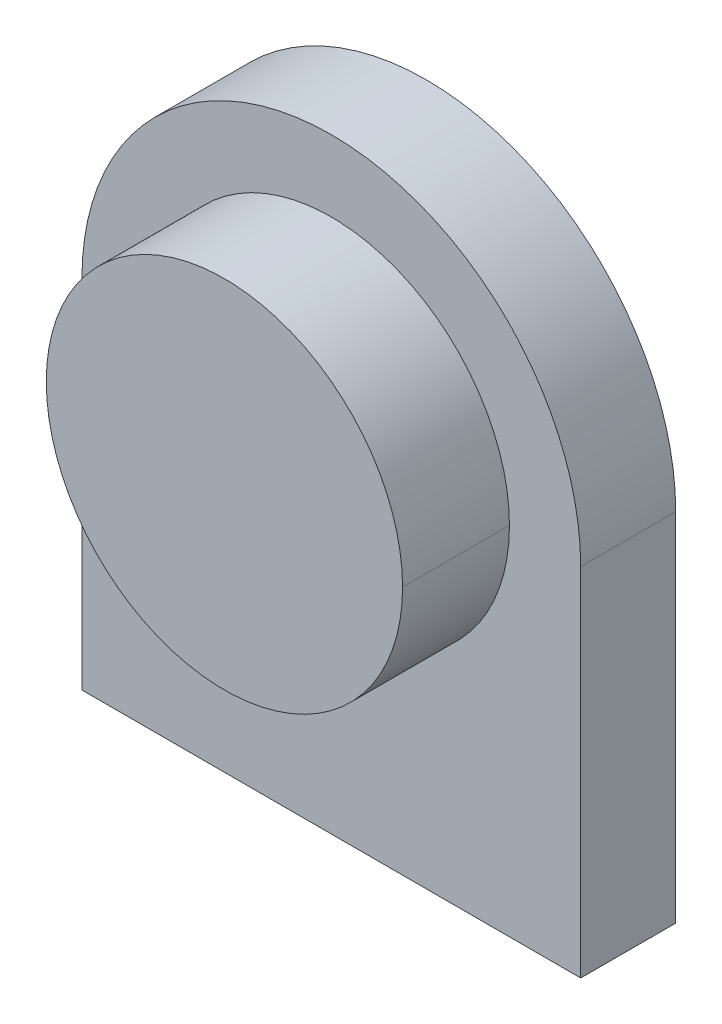
ISO-10303-21;
HEADER;
FILE_DESCRIPTION(('STEP AP214'),'2;1');
FILE_NAME('part.step','',(''),(''),'','','');
FILE_SCHEMA(('AUTOMOTIVE_DESIGN { 1 0 10303 214 1 1 1 1 }'));
ENDSEC;
DATA;
#1=APPLICATION_CONTEXT('core data for automotive mechanical design processes');
#2=APPLICATION_PROTOCOL_DEFINITION('international standard','automotive_design',2000,#1);
#3=PRODUCT_CONTEXT('',#1,'mechanical');
#4=PRODUCT('Part','Part','',(#3));
#5=PRODUCT_RELATED_PRODUCT_CATEGORY('part','',(#4));
#6=PRODUCT_DEFINITION_FORMATION('','',#4);
#7=PRODUCT_DEFINITION_CONTEXT('part definition',#1,'design');
#8=PRODUCT_DEFINITION('design','',#6,#7);
#9=PRODUCT_DEFINITION_SHAPE('','',#8);
#10=(LENGTH_UNIT() NAMED_UNIT(*) SI_UNIT(.MILLI.,.METRE.));
#11=(NAMED_UNIT(*) PLANE_ANGLE_UNIT() SI_UNIT($,.RADIAN.));
#12=(NAMED_UNIT(*) SI_UNIT($,.STERADIAN.) SOLID_ANGLE_UNIT());
#13=UNCERTAINTY_MEASURE_WITH_UNIT(LENGTH_MEASURE(1.E-05),#10,'distance_accuracy_value','');
#14=(GEOMETRIC_REPRESENTATION_CONTEXT(3) GLOBAL_UNCERTAINTY_ASSIGNED_CONTEXT((#13)) GLOBAL_UNIT_ASSIGNED_CONTEXT((#10,
#11,#12)) REPRESENTATION_CONTEXT('',''));
#15=CARTESIAN_POINT('',(0.,0.,0.));
#16=DIRECTION('',(0.,0.,1.));
#17=DIRECTION('',(1.,0.,0.));
#18=AXIS2_PLACEMENT_3D('',#15,#16,#17);
#19=CARTESIAN_POINT('',(0.,0.,5.));
#20=DIRECTION('',(0.,0.,-1.));
#21=DIRECTION('',(-1.,0.,0.));
#22=AXIS2_PLACEMENT_3D('',#19,#20,#21);
#23=CYLINDRICAL_SURFACE('',#22,7.5);
#24=DIRECTION('',(0.,0.,-1.));
#25=VECTOR('',#24,1.);
#26=CARTESIAN_POINT('',(-7.5,0.,5.));
#27=LINE('',#26,#25);
#28=CARTESIAN_POINT('',(-7.5,0.,4.5));
#29=VERTEX_POINT('',#28);
#30=CARTESIAN_POINT('',(-7.5,0.,0.));
#31=VERTEX_POINT('',#30);
#32=EDGE_CURVE('E167',#29,#31,#27,.T.);
#33=ORIENTED_EDGE('',*,*,#32,.F.);
#34=CARTESIAN_POINT('',(0.,0.,4.5));
#35=DIRECTION('',(0.,0.,1.));
#36=DIRECTION('',(1.,0.,0.));
#37=AXIS2_PLACEMENT_3D('',#34,#35,#36);
#38=CIRCLE('',#37,7.5);
#39=CARTESIAN_POINT('',(7.5,0.,4.5));
#40=VERTEX_POINT('',#39);
#41=EDGE_CURVE('E68',#40,#29,#38,.T.);
#42=ORIENTED_EDGE('',*,*,#41,.F.);
#43=DIRECTION('',(0.,0.,-1.));
#44=VECTOR('',#43,1.);
#45=CARTESIAN_POINT('',(7.5,0.,5.));
#46=LINE('',#45,#44);
#47=CARTESIAN_POINT('',(7.5,0.,0.));
#48=VERTEX_POINT('',#47);
#49=EDGE_CURVE('E101',#40,#48,#46,.T.);
#50=ORIENTED_EDGE('',*,*,#49,.T.);
#51=CARTESIAN_POINT('',(0.,0.,0.));
#52=DIRECTION('',(0.,0.,1.));
#53=DIRECTION('',(1.,0.,0.));
#54=AXIS2_PLACEMENT_3D('',#51,#52,#53);
#55=CIRCLE('',#54,7.5);
#56=EDGE_CURVE('E170',#48,#31,#55,.T.);
#57=ORIENTED_EDGE('',*,*,#56,.T.);
#58=EDGE_LOOP('',(#33,#42,#50,#57));
#59=FACE_BOUND('',#58,.T.);
#60=ADVANCED_FACE('F51',(#59),#23,.T.);
#61=CARTESIAN_POINT('',(0.,0.,5.));
#62=DIRECTION('',(0.,0.,-1.));
#63=DIRECTION('',(-1.,0.,0.));
#64=AXIS2_PLACEMENT_3D('',#61,#62,#63);
#65=CYLINDRICAL_SURFACE('',#64,7.5);
#66=ORIENTED_EDGE('',*,*,#49,.F.);
#67=EDGE_CURVE('E366',#29,#40,#38,.T.);
#68=ORIENTED_EDGE('',*,*,#67,.F.);
#69=ORIENTED_EDGE('',*,*,#32,.T.);
#70=CARTESIAN_POINT('',(0.,0.,0.));
#71=DIRECTION('',(0.,0.,1.));
#72=DIRECTION('',(1.,0.,0.));
#73=AXIS2_PLACEMENT_3D('',#70,#71,#72);
#74=CIRCLE('',#73,7.5);
#75=EDGE_CURVE('E125',#31,#48,#74,.T.);
#76=ORIENTED_EDGE('',*,*,#75,.T.);
#77=EDGE_LOOP('',(#66,#68,#69,#76));
#78=FACE_BOUND('',#77,.T.);
#79=ADVANCED_FACE('F269',(#78),#65,.T.);
#80=CARTESIAN_POINT('',(0.,0.,-4.));
#81=DIRECTION('',(0.,0.,1.));
#82=DIRECTION('',(1.,0.,0.));
#83=AXIS2_PLACEMENT_3D('',#80,#81,#82);
#84=CYLINDRICAL_SURFACE('',#83,10.5);
#85=CARTESIAN_POINT('',(0.,0.,-4.));
#86=DIRECTION('',(0.,0.,-1.));
#87=DIRECTION('',(-1.,0.,0.));
#88=AXIS2_PLACEMENT_3D('',#85,#86,#87);
#89=CIRCLE('',#88,10.5);
#90=CARTESIAN_POINT('',(-10.5,0.,-4.));
#91=VERTEX_POINT('',#90);
#92=CARTESIAN_POINT('',(10.5,0.,-4.));
#93=VERTEX_POINT('',#92);
#94=EDGE_CURVE('E55',#91,#93,#89,.T.);
#95=ORIENTED_EDGE('',*,*,#94,.F.);
#96=DIRECTION('',(0.,0.,1.));
#97=VECTOR('',#96,1.);
#98=CARTESIAN_POINT('',(-10.5,0.,-4.));
#99=LINE('',#98,#97);
#100=CARTESIAN_POINT('',(-10.5,0.,0.));
#101=VERTEX_POINT('',#100);
#102=EDGE_CURVE('E12',#91,#101,#99,.T.);
#103=ORIENTED_EDGE('',*,*,#102,.T.);
#104=CARTESIAN_POINT('',(0.,0.,0.));
#105=DIRECTION('',(0.,0.,-1.));
#106=DIRECTION('',(-1.,0.,0.));
#107=AXIS2_PLACEMENT_3D('',#104,#105,#106);
#108=CIRCLE('',#107,10.5);
#109=CARTESIAN_POINT('',(10.5,0.,0.));
#110=VERTEX_POINT('',#109);
#111=EDGE_CURVE('E61',#101,#110,#108,.T.);
#112=ORIENTED_EDGE('',*,*,#111,.T.);
#113=DIRECTION('',(0.,0.,1.));
#114=VECTOR('',#113,1.);
#115=CARTESIAN_POINT('',(10.5,0.,-4.));
#116=LINE('',#115,#114);
#117=EDGE_CURVE('E116',#93,#110,#116,.T.);
#118=ORIENTED_EDGE('',*,*,#117,.F.);
#119=EDGE_LOOP('',(#95,#103,#112,#118));
#120=FACE_BOUND('',#119,.T.);
#121=ADVANCED_FACE('F119',(#120),#84,.T.);
#122=CARTESIAN_POINT('',(0.,0.,-4.));
#123=DIRECTION('',(0.,0.,-1.));
#124=DIRECTION('',(0.,-1.,0.));
#125=AXIS2_PLACEMENT_3D('',#122,#123,#124);
#126=PLANE('',#125);
#127=CARTESIAN_POINT('',(0.,0.,-4.));
#128=DIRECTION('',(0.,0.,-1.));
#129=DIRECTION('',(0.,1.,0.));
#130=AXIS2_PLACEMENT_3D('',#127,#128,#129);
#131=CIRCLE('',#130,9.25);
#132=CARTESIAN_POINT('',(0.,9.25,-4.));
#133=VERTEX_POINT('',#132);
#134=EDGE_CURVE('E155',#133,#133,#131,.T.);
#135=ORIENTED_EDGE('',*,*,#134,.F.);
#136=EDGE_LOOP('',(#135));
#137=FACE_BOUND('',#136,.T.);
#138=ORIENTED_EDGE('',*,*,#94,.T.);
#139=DIRECTION('',(0.,1.,0.));
#140=VECTOR('',#139,1.);
#141=CARTESIAN_POINT('',(10.5,0.,-4.));
#142=LINE('',#141,#140);
#143=CARTESIAN_POINT('',(10.5,-15.,-4.));
#144=VERTEX_POINT('',#143);
#145=EDGE_CURVE('E111',#144,#93,#142,.T.);
#146=ORIENTED_EDGE('',*,*,#145,.F.);
#147=DIRECTION('',(-1.,0.,0.));
#148=VECTOR('',#147,1.);
#149=CARTESIAN_POINT('',(0.,-15.,-4.));
#150=LINE('',#149,#148);
#151=CARTESIAN_POINT('',(-10.5,-15.,-4.));
#152=VERTEX_POINT('',#151);
#153=EDGE_CURVE('E134',#144,#152,#150,.T.);
#154=ORIENTED_EDGE('',*,*,#153,.T.);
#155=DIRECTION('',(0.,1.,0.));
#156=VECTOR('',#155,1.);
#157=CARTESIAN_POINT('',(-10.5,0.,-4.));
#158=LINE('',#157,#156);
#159=EDGE_CURVE('E113',#152,#91,#158,.T.);
#160=ORIENTED_EDGE('',*,*,#159,.T.);
#161=EDGE_LOOP('',(#138,#146,#154,#160));
#162=FACE_BOUND('',#161,.T.);
#163=ADVANCED_FACE('F108',(#137,#162),#126,.T.);
#164=CARTESIAN_POINT('',(0.,0.,0.));
#165=DIRECTION('',(0.,0.,-1.));
#166=DIRECTION('',(0.,-1.,0.));
#167=AXIS2_PLACEMENT_3D('',#164,#165,#166);
#168=PLANE('',#167);
#169=ORIENTED_EDGE('',*,*,#111,.F.);
#170=DIRECTION('',(0.,1.,0.));
#171=VECTOR('',#170,1.);
#172=CARTESIAN_POINT('',(-10.5,0.,0.));
#173=LINE('',#172,#171);
#174=CARTESIAN_POINT('',(-10.5,-15.,0.));
#175=VERTEX_POINT('',#174);
#176=EDGE_CURVE('E143',#175,#101,#173,.T.);
#177=ORIENTED_EDGE('',*,*,#176,.F.);
#178=DIRECTION('',(-1.,0.,0.));
#179=VECTOR('',#178,1.);
#180=CARTESIAN_POINT('',(0.,-15.,0.));
#181=LINE('',#180,#179);
#182=CARTESIAN_POINT('',(10.5,-15.,0.));
#183=VERTEX_POINT('',#182);
#184=EDGE_CURVE('E147',#183,#175,#181,.T.);
#185=ORIENTED_EDGE('',*,*,#184,.F.);
#186=DIRECTION('',(0.,1.,0.));
#187=VECTOR('',#186,1.);
#188=CARTESIAN_POINT('',(10.5,0.,0.));
#189=LINE('',#188,#187);
#190=EDGE_CURVE('E151',#183,#110,#189,.T.);
#191=ORIENTED_EDGE('',*,*,#190,.T.);
#192=EDGE_LOOP('',(#169,#177,#185,#191));
#193=FACE_BOUND('',#192,.T.);
#194=ORIENTED_EDGE('',*,*,#75,.F.);
#195=ORIENTED_EDGE('',*,*,#56,.F.);
#196=EDGE_LOOP('',(#194,#195));
#197=FACE_BOUND('',#196,.T.);
#198=ADVANCED_FACE('F209',(#193,#197),#168,.F.);
#199=CARTESIAN_POINT('',(0.,0.,-4.));
#200=DIRECTION('',(0.,0.,-1.));
#201=DIRECTION('',(0.,1.,0.));
#202=AXIS2_PLACEMENT_3D('',#199,#200,#201);
#203=CONICAL_SURFACE('',#202,9.25,0.785398163397449);
#204=CARTESIAN_POINT('',(0.,0.,-3.25));
#205=DIRECTION('',(0.,0.,-1.));
#206=DIRECTION('',(0.,1.,0.));
#207=AXIS2_PLACEMENT_3D('',#204,#205,#206);
#208=CIRCLE('',#207,8.5);
#209=CARTESIAN_POINT('',(0.,8.5,-3.25));
#210=VERTEX_POINT('',#209);
#211=EDGE_CURVE('E160',#210,#210,#208,.T.);
#212=ORIENTED_EDGE('',*,*,#211,.F.);
#213=EDGE_LOOP('',(#212));
#214=FACE_BOUND('',#213,.T.);
#215=ORIENTED_EDGE('',*,*,#134,.T.);
#216=EDGE_LOOP('',(#215));
#217=FACE_BOUND('',#216,.T.);
#218=ADVANCED_FACE('F205',(#214,#217),#203,.F.);
#219=CARTESIAN_POINT('',(0.,0.,-1.));
#220=DIRECTION('',(0.,0.,-1.));
#221=DIRECTION('',(0.,-1.,0.));
#222=AXIS2_PLACEMENT_3D('',#219,#220,#221);
#223=PLANE('',#222);
#224=CARTESIAN_POINT('',(0.,0.,-1.));
#225=DIRECTION('',(0.,0.,-1.));
#226=DIRECTION('',(-1.,0.,0.));
#227=AXIS2_PLACEMENT_3D('',#224,#225,#226);
#228=CIRCLE('',#227,8.5);
#229=CARTESIAN_POINT('',(-8.5,0.,-1.));
#230=VERTEX_POINT('',#229);
#231=EDGE_CURVE('E117',#230,#230,#228,.T.);
#232=ORIENTED_EDGE('',*,*,#231,.T.);
#233=EDGE_LOOP('',(#232));
#234=FACE_BOUND('',#233,.T.);
#235=ADVANCED_FACE('F53',(#234),#223,.T.);
#236=CARTESIAN_POINT('',(0.,0.,-1.));
#237=DIRECTION('',(0.,0.,-1.));
#238=DIRECTION('',(-1.,0.,0.));
#239=AXIS2_PLACEMENT_3D('',#236,#237,#238);
#240=CYLINDRICAL_SURFACE('',#239,8.5);
#241=ORIENTED_EDGE('',*,*,#211,.T.);
#242=EDGE_LOOP('',(#241));
#243=FACE_BOUND('',#242,.T.);
#244=ORIENTED_EDGE('',*,*,#231,.F.);
#245=EDGE_LOOP('',(#244));
#246=FACE_BOUND('',#245,.T.);
#247=ADVANCED_FACE('F218',(#243,#246),#240,.F.);
#248=CARTESIAN_POINT('',(-10.5,0.,-4.));
#249=DIRECTION('',(1.,0.,0.));
#250=DIRECTION('',(0.,0.,-1.));
#251=AXIS2_PLACEMENT_3D('',#248,#249,#250);
#252=PLANE('',#251);
#253=ORIENTED_EDGE('',*,*,#176,.T.);
#254=ORIENTED_EDGE('',*,*,#102,.F.);
#255=ORIENTED_EDGE('',*,*,#159,.F.);
#256=DIRECTION('',(0.,0.,1.));
#257=VECTOR('',#256,1.);
#258=CARTESIAN_POINT('',(-10.5,-15.,-4.));
#259=LINE('',#258,#257);
#260=EDGE_CURVE('E133',#152,#175,#259,.T.);
#261=ORIENTED_EDGE('',*,*,#260,.T.);
#262=EDGE_LOOP('',(#253,#254,#255,#261));
#263=FACE_BOUND('',#262,.T.);
#264=ADVANCED_FACE('F224',(#263),#252,.F.);
#265=CARTESIAN_POINT('',(10.5,0.,-4.));
#266=DIRECTION('',(1.,0.,0.));
#267=DIRECTION('',(0.,1.,0.));
#268=AXIS2_PLACEMENT_3D('',#265,#266,#267);
#269=PLANE('',#268);
#270=ORIENTED_EDGE('',*,*,#190,.F.);
#271=DIRECTION('',(0.,0.,1.));
#272=VECTOR('',#271,1.);
#273=CARTESIAN_POINT('',(10.5,-15.,-4.));
#274=LINE('',#273,#272);
#275=EDGE_CURVE('E130',#144,#183,#274,.T.);
#276=ORIENTED_EDGE('',*,*,#275,.F.);
#277=ORIENTED_EDGE('',*,*,#145,.T.);
#278=ORIENTED_EDGE('',*,*,#117,.T.);
#279=EDGE_LOOP('',(#270,#276,#277,#278));
#280=FACE_BOUND('',#279,.T.);
#281=ADVANCED_FACE('F128',(#280),#269,.T.);
#282=CARTESIAN_POINT('',(0.,-15.,-4.));
#283=DIRECTION('',(0.,1.,0.));
#284=DIRECTION('',(-1.,0.,0.));
#285=AXIS2_PLACEMENT_3D('',#282,#283,#284);
#286=PLANE('',#285);
#287=ORIENTED_EDGE('',*,*,#184,.T.);
#288=ORIENTED_EDGE('',*,*,#260,.F.);
#289=ORIENTED_EDGE('',*,*,#153,.F.);
#290=ORIENTED_EDGE('',*,*,#275,.T.);
#291=EDGE_LOOP('',(#287,#288,#289,#290));
#292=FACE_BOUND('',#291,.T.);
#293=ADVANCED_FACE('F254',(#292),#286,.F.);
#294=CARTESIAN_POINT('',(0.,0.,4.5));
#295=DIRECTION('',(0.,0.,1.));
#296=DIRECTION('',(1.,0.,0.));
#297=AXIS2_PLACEMENT_3D('',#294,#295,#296);
#298=PLANE('',#297);
#299=ORIENTED_EDGE('',*,*,#41,.T.);
#300=ORIENTED_EDGE('',*,*,#67,.T.);
#301=EDGE_LOOP('',(#299,#300));
#302=FACE_BOUND('',#301,.T.);
#303=ADVANCED_FACE('F260',(#302),#298,.T.);
#304=CLOSED_SHELL('',(#60,#79,#121,#163,#198,#218,#235,#247,#264,#281,#293,#303));
#305=MANIFOLD_SOLID_BREP('B2',#304);
#306=ADVANCED_BREP_SHAPE_REPRESENTATION('',(#18,#305),#14);
#307=SHAPE_DEFINITION_REPRESENTATION(#9,#306);
ENDSEC;
END-ISO-10303-21;
